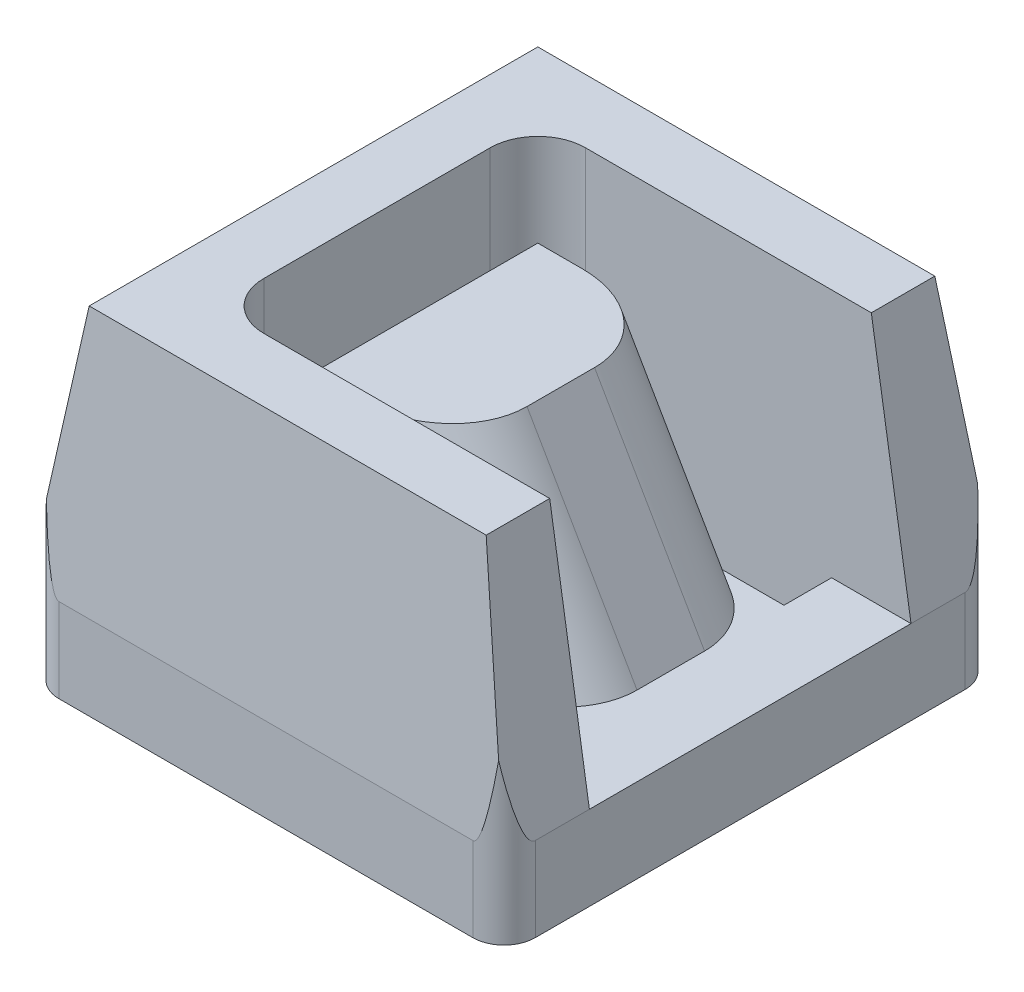
ISO-10303-21;
HEADER;
FILE_DESCRIPTION(('STEP AP214'),'2;1');
FILE_NAME('part.step','',(''),(''),'','','');
FILE_SCHEMA(('AUTOMOTIVE_DESIGN { 1 0 10303 214 1 1 1 1 }'));
ENDSEC;
DATA;
#1=APPLICATION_CONTEXT('core data for automotive mechanical design processes');
#2=APPLICATION_PROTOCOL_DEFINITION('international standard','automotive_design',2000,#1);
#3=PRODUCT_CONTEXT('',#1,'mechanical');
#4=PRODUCT('Part','Part','',(#3));
#5=PRODUCT_RELATED_PRODUCT_CATEGORY('part','',(#4));
#6=PRODUCT_DEFINITION_FORMATION('','',#4);
#7=PRODUCT_DEFINITION_CONTEXT('part definition',#1,'design');
#8=PRODUCT_DEFINITION('design','',#6,#7);
#9=PRODUCT_DEFINITION_SHAPE('','',#8);
#10=(LENGTH_UNIT() NAMED_UNIT(*) SI_UNIT(.MILLI.,.METRE.));
#11=(NAMED_UNIT(*) PLANE_ANGLE_UNIT() SI_UNIT($,.RADIAN.));
#12=(NAMED_UNIT(*) SI_UNIT($,.STERADIAN.) SOLID_ANGLE_UNIT());
#13=UNCERTAINTY_MEASURE_WITH_UNIT(LENGTH_MEASURE(1.E-05),#10,'distance_accuracy_value','');
#14=(GEOMETRIC_REPRESENTATION_CONTEXT(3) GLOBAL_UNCERTAINTY_ASSIGNED_CONTEXT((#13)) GLOBAL_UNIT_ASSIGNED_CONTEXT((#10,
#11,#12)) REPRESENTATION_CONTEXT('',''));
#15=CARTESIAN_POINT('',(0.,0.,0.));
#16=DIRECTION('',(0.,0.,1.));
#17=DIRECTION('',(1.,0.,0.));
#18=AXIS2_PLACEMENT_3D('',#15,#16,#17);
#19=CARTESIAN_POINT('',(14.986,1.3462,3.937));
#20=DIRECTION('',(0.,-1.,0.));
#21=DIRECTION('',(1.,0.,0.));
#22=AXIS2_PLACEMENT_3D('',#19,#20,#21);
#23=PLANE('',#22);
#24=DIRECTION('',(1.,0.,0.));
#25=VECTOR('',#24,1.);
#26=CARTESIAN_POINT('',(-2.159,1.34619999999999,2.57211270759132));
#27=LINE('',#26,#25);
#28=CARTESIAN_POINT('',(2.54,1.34619999999999,2.57211270759132));
#29=VERTEX_POINT('',#28);
#30=CARTESIAN_POINT('',(3.81,1.3462,2.57211270759132));
#31=VERTEX_POINT('',#30);
#32=EDGE_CURVE('E303',#29,#31,#27,.T.);
#33=ORIENTED_EDGE('',*,*,#32,.T.);
#34=DIRECTION('',(0.,0.,1.));
#35=VECTOR('',#34,1.);
#36=CARTESIAN_POINT('',(3.81,1.3462,2.69709573841941));
#37=LINE('',#36,#35);
#38=CARTESIAN_POINT('',(3.81,1.3462,-2.57211270759132));
#39=VERTEX_POINT('',#38);
#40=EDGE_CURVE('E287',#39,#31,#37,.T.);
#41=ORIENTED_EDGE('',*,*,#40,.F.);
#42=DIRECTION('',(-1.,0.,0.));
#43=VECTOR('',#42,1.);
#44=CARTESIAN_POINT('',(3.81,1.3462,-2.57211270759132));
#45=LINE('',#44,#43);
#46=CARTESIAN_POINT('',(2.54,1.34619999999999,-2.57211270759132));
#47=VERTEX_POINT('',#46);
#48=EDGE_CURVE('E300',#39,#47,#45,.T.);
#49=ORIENTED_EDGE('',*,*,#48,.T.);
#50=DIRECTION('',(0.,0.,-1.));
#51=VECTOR('',#50,1.);
#52=CARTESIAN_POINT('',(2.54,1.34619999999999,-2.57211270759132));
#53=LINE('',#52,#51);
#54=CARTESIAN_POINT('',(2.54,1.34619999999999,-1.81011270759132));
#55=VERTEX_POINT('',#54);
#56=EDGE_CURVE('E505',#55,#47,#53,.T.);
#57=ORIENTED_EDGE('',*,*,#56,.F.);
#58=DIRECTION('',(-1.,0.,0.));
#59=VECTOR('',#58,1.);
#60=CARTESIAN_POINT('',(-1.397,1.34619999999999,-1.81011270759132));
#61=LINE('',#60,#59);
#62=CARTESIAN_POINT('',(1.07353031625835,1.34619999999999,-1.81011270759132));
#63=VERTEX_POINT('',#62);
#64=EDGE_CURVE('E510',#55,#63,#61,.T.);
#65=ORIENTED_EDGE('',*,*,#64,.T.);
#66=CARTESIAN_POINT('',(1.07353031625835,1.34619999999999,-0.540112707591319));
#67=DIRECTION('',(0.,-1.,0.));
#68=DIRECTION('',(-1.,0.,0.));
#69=AXIS2_PLACEMENT_3D('',#66,#67,#68);
#70=ELLIPSE('',#69,1.46646968374165,1.27);
#71=CARTESIAN_POINT('',(2.54,1.34619999999999,-0.540112707591319));
#72=VERTEX_POINT('',#71);
#73=EDGE_CURVE('E439',#72,#63,#70,.F.);
#74=ORIENTED_EDGE('',*,*,#73,.F.);
#75=DIRECTION('',(0.,0.,-1.));
#76=VECTOR('',#75,1.);
#77=CARTESIAN_POINT('',(2.54,1.34619999999999,-1.81011270759132));
#78=LINE('',#77,#76);
#79=CARTESIAN_POINT('',(2.54,1.34619999999999,0.540112707591318));
#80=VERTEX_POINT('',#79);
#81=EDGE_CURVE('E393',#80,#72,#78,.T.);
#82=ORIENTED_EDGE('',*,*,#81,.F.);
#83=CARTESIAN_POINT('',(1.07353031625835,1.34619999999999,0.540112707591318));
#84=DIRECTION('',(0.,-1.,0.));
#85=DIRECTION('',(-1.,0.,0.));
#86=AXIS2_PLACEMENT_3D('',#83,#84,#85);
#87=ELLIPSE('',#86,1.46646968374165,1.27);
#88=CARTESIAN_POINT('',(1.07353031625835,1.34619999999999,1.81011270759132));
#89=VERTEX_POINT('',#88);
#90=EDGE_CURVE('E518',#89,#80,#87,.F.);
#91=ORIENTED_EDGE('',*,*,#90,.F.);
#92=DIRECTION('',(1.,0.,0.));
#93=VECTOR('',#92,1.);
#94=CARTESIAN_POINT('',(2.54,1.34619999999999,1.81011270759132));
#95=LINE('',#94,#93);
#96=CARTESIAN_POINT('',(2.54,1.34619999999999,1.81011270759132));
#97=VERTEX_POINT('',#96);
#98=EDGE_CURVE('E509',#89,#97,#95,.T.);
#99=ORIENTED_EDGE('',*,*,#98,.T.);
#100=DIRECTION('',(0.,0.,-1.));
#101=VECTOR('',#100,1.);
#102=CARTESIAN_POINT('',(2.54,1.34619999999999,1.81011270759132));
#103=LINE('',#102,#101);
#104=EDGE_CURVE('E503',#29,#97,#103,.T.);
#105=ORIENTED_EDGE('',*,*,#104,.F.);
#106=EDGE_LOOP('',(#33,#41,#49,#57,#65,#74,#82,#91,#99,#105));
#107=FACE_BOUND('',#106,.T.);
#108=ADVANCED_FACE('F43',(#107),#23,.F.);
#109=CARTESIAN_POINT('',(-3.81,0.,3.937));
#110=DIRECTION('',(0.,1.,0.));
#111=DIRECTION('',(0.,0.,1.));
#112=AXIS2_PLACEMENT_3D('',#109,#110,#111);
#113=PLANE('',#112);
#114=DIRECTION('',(1.,0.,0.));
#115=VECTOR('',#114,1.);
#116=CARTESIAN_POINT('',(2.54,0.,-1.81011270759132));
#117=LINE('',#116,#115);
#118=CARTESIAN_POINT('',(-1.397,0.,-1.81011270759132));
#119=VERTEX_POINT('',#118);
#120=CARTESIAN_POINT('',(2.54,0.,-1.81011270759132));
#121=VERTEX_POINT('',#120);
#122=EDGE_CURVE('E607',#119,#121,#117,.T.);
#123=ORIENTED_EDGE('',*,*,#122,.T.);
#124=DIRECTION('',(0.,0.,-1.));
#125=VECTOR('',#124,1.);
#126=CARTESIAN_POINT('',(2.54,0.,-2.57211270759132));
#127=LINE('',#126,#125);
#128=CARTESIAN_POINT('',(2.54,0.,-2.57211270759132));
#129=VERTEX_POINT('',#128);
#130=EDGE_CURVE('E604',#121,#129,#127,.T.);
#131=ORIENTED_EDGE('',*,*,#130,.T.);
#132=DIRECTION('',(-1.,0.,0.));
#133=VECTOR('',#132,1.);
#134=CARTESIAN_POINT('',(2.54,0.,-2.57211270759132));
#135=LINE('',#134,#133);
#136=CARTESIAN_POINT('',(-1.397,0.,-2.57211270759132));
#137=VERTEX_POINT('',#136);
#138=EDGE_CURVE('E593',#129,#137,#135,.T.);
#139=ORIENTED_EDGE('',*,*,#138,.T.);
#140=CARTESIAN_POINT('',(-1.397,0.,-1.81011270759132));
#141=DIRECTION('',(0.,1.,0.));
#142=DIRECTION('',(0.,0.,1.));
#143=AXIS2_PLACEMENT_3D('',#140,#141,#142);
#144=CIRCLE('',#143,0.762);
#145=CARTESIAN_POINT('',(-2.159,0.,-1.81011270759132));
#146=VERTEX_POINT('',#145);
#147=EDGE_CURVE('E433',#137,#146,#144,.T.);
#148=ORIENTED_EDGE('',*,*,#147,.T.);
#149=DIRECTION('',(0.,0.,1.));
#150=VECTOR('',#149,1.);
#151=CARTESIAN_POINT('',(-2.159,0.,-2.57211270759132));
#152=LINE('',#151,#150);
#153=CARTESIAN_POINT('',(-2.159,0.,1.81011270759132));
#154=VERTEX_POINT('',#153);
#155=EDGE_CURVE('E524',#146,#154,#152,.T.);
#156=ORIENTED_EDGE('',*,*,#155,.T.);
#157=CARTESIAN_POINT('',(-1.397,0.,1.81011270759132));
#158=DIRECTION('',(0.,1.,0.));
#159=DIRECTION('',(0.,0.,1.));
#160=AXIS2_PLACEMENT_3D('',#157,#158,#159);
#161=CIRCLE('',#160,0.762);
#162=CARTESIAN_POINT('',(-1.397,0.,2.57211270759132));
#163=VERTEX_POINT('',#162);
#164=EDGE_CURVE('E427',#154,#163,#161,.T.);
#165=ORIENTED_EDGE('',*,*,#164,.T.);
#166=DIRECTION('',(1.,0.,0.));
#167=VECTOR('',#166,1.);
#168=CARTESIAN_POINT('',(-2.159,0.,2.57211270759132));
#169=LINE('',#168,#167);
#170=CARTESIAN_POINT('',(2.54,0.,2.57211270759132));
#171=VERTEX_POINT('',#170);
#172=EDGE_CURVE('E574',#163,#171,#169,.T.);
#173=ORIENTED_EDGE('',*,*,#172,.T.);
#174=DIRECTION('',(0.,0.,-1.));
#175=VECTOR('',#174,1.);
#176=CARTESIAN_POINT('',(2.54,0.,1.81011270759132));
#177=LINE('',#176,#175);
#178=CARTESIAN_POINT('',(2.54,0.,1.81011270759132));
#179=VERTEX_POINT('',#178);
#180=EDGE_CURVE('E617',#171,#179,#177,.T.);
#181=ORIENTED_EDGE('',*,*,#180,.T.);
#182=DIRECTION('',(-1.,0.,0.));
#183=VECTOR('',#182,1.);
#184=CARTESIAN_POINT('',(-1.397,0.,1.81011270759132));
#185=LINE('',#184,#183);
#186=CARTESIAN_POINT('',(-1.397,0.,1.81011270759132));
#187=VERTEX_POINT('',#186);
#188=EDGE_CURVE('E614',#179,#187,#185,.T.);
#189=ORIENTED_EDGE('',*,*,#188,.T.);
#190=DIRECTION('',(0.,0.,-1.));
#191=VECTOR('',#190,1.);
#192=CARTESIAN_POINT('',(-1.397,0.,-1.81011270759132));
#193=LINE('',#192,#191);
#194=EDGE_CURVE('E610',#187,#119,#193,.T.);
#195=ORIENTED_EDGE('',*,*,#194,.T.);
#196=EDGE_LOOP('',(#123,#131,#139,#148,#156,#165,#173,#181,#189,#195));
#197=FACE_BOUND('',#196,.T.);
#198=CARTESIAN_POINT('',(3.31,0.,-3.437));
#199=DIRECTION('',(0.,1.,0.));
#200=DIRECTION('',(0.,0.,1.));
#201=AXIS2_PLACEMENT_3D('',#198,#199,#200);
#202=CIRCLE('',#201,0.5);
#203=CARTESIAN_POINT('',(3.31,0.,-3.937));
#204=VERTEX_POINT('',#203);
#205=CARTESIAN_POINT('',(3.81,0.,-3.437));
#206=VERTEX_POINT('',#205);
#207=EDGE_CURVE('E453',#204,#206,#202,.F.);
#208=ORIENTED_EDGE('',*,*,#207,.T.);
#209=DIRECTION('',(0.,0.,-1.));
#210=VECTOR('',#209,1.);
#211=CARTESIAN_POINT('',(3.81,0.,2.1971));
#212=LINE('',#211,#210);
#213=CARTESIAN_POINT('',(3.81,0.,3.437));
#214=VERTEX_POINT('',#213);
#215=EDGE_CURVE('E306',#214,#206,#212,.T.);
#216=ORIENTED_EDGE('',*,*,#215,.F.);
#217=CARTESIAN_POINT('',(3.31,0.,3.437));
#218=DIRECTION('',(0.,1.,0.));
#219=DIRECTION('',(0.,0.,1.));
#220=AXIS2_PLACEMENT_3D('',#217,#218,#219);
#221=CIRCLE('',#220,0.5);
#222=CARTESIAN_POINT('',(3.31,0.,3.937));
#223=VERTEX_POINT('',#222);
#224=EDGE_CURVE('E450',#214,#223,#221,.F.);
#225=ORIENTED_EDGE('',*,*,#224,.T.);
#226=DIRECTION('',(1.,0.,0.));
#227=VECTOR('',#226,1.);
#228=CARTESIAN_POINT('',(-3.81,0.,3.937));
#229=LINE('',#228,#227);
#230=CARTESIAN_POINT('',(-3.31,0.,3.937));
#231=VERTEX_POINT('',#230);
#232=EDGE_CURVE('E336',#231,#223,#229,.T.);
#233=ORIENTED_EDGE('',*,*,#232,.F.);
#234=CARTESIAN_POINT('',(-3.31,0.,3.437));
#235=DIRECTION('',(0.,1.,0.));
#236=DIRECTION('',(0.,0.,1.));
#237=AXIS2_PLACEMENT_3D('',#234,#235,#236);
#238=CIRCLE('',#237,0.5);
#239=CARTESIAN_POINT('',(-3.81,0.,3.437));
#240=VERTEX_POINT('',#239);
#241=EDGE_CURVE('E457',#231,#240,#238,.F.);
#242=ORIENTED_EDGE('',*,*,#241,.T.);
#243=DIRECTION('',(0.,0.,-1.));
#244=VECTOR('',#243,1.);
#245=CARTESIAN_POINT('',(-3.81,0.,3.937));
#246=LINE('',#245,#244);
#247=CARTESIAN_POINT('',(-3.81,0.,-3.437));
#248=VERTEX_POINT('',#247);
#249=EDGE_CURVE('E340',#240,#248,#246,.T.);
#250=ORIENTED_EDGE('',*,*,#249,.T.);
#251=CARTESIAN_POINT('',(-3.31,0.,-3.437));
#252=DIRECTION('',(0.,1.,0.));
#253=DIRECTION('',(0.,0.,1.));
#254=AXIS2_PLACEMENT_3D('',#251,#252,#253);
#255=CIRCLE('',#254,0.5);
#256=CARTESIAN_POINT('',(-3.31,0.,-3.937));
#257=VERTEX_POINT('',#256);
#258=EDGE_CURVE('E460',#248,#257,#255,.F.);
#259=ORIENTED_EDGE('',*,*,#258,.T.);
#260=DIRECTION('',(1.,0.,0.));
#261=VECTOR('',#260,1.);
#262=CARTESIAN_POINT('',(-3.81,0.,-3.937));
#263=LINE('',#262,#261);
#264=EDGE_CURVE('E342',#257,#204,#263,.T.);
#265=ORIENTED_EDGE('',*,*,#264,.T.);
#266=EDGE_LOOP('',(#208,#216,#225,#233,#242,#250,#259,#265));
#267=FACE_BOUND('',#266,.T.);
#268=ADVANCED_FACE('F549',(#197,#267),#113,.F.);
#269=CARTESIAN_POINT('',(1.44014773719376,0.711199999999993,0.540112707591318));
#270=DIRECTION('',(-0.500000000000001,0.866025403784438,0.));
#271=DIRECTION('',(-0.866025403784438,-0.500000000000001,0.));
#272=AXIS2_PLACEMENT_3D('',#269,#270,#271);
#273=CYLINDRICAL_SURFACE('',#272,1.27);
#274=DIRECTION('',(-0.500000000000001,0.866025403784438,0.));
#275=VECTOR('',#274,1.);
#276=CARTESIAN_POINT('',(1.03881943648107,1.40632100734966,1.81011270759132));
#277=LINE('',#276,#275);
#278=CARTESIAN_POINT('',(-0.686233304231633,4.39419999999999,1.81011270759132));
#279=VERTEX_POINT('',#278);
#280=EDGE_CURVE('E400',#89,#279,#277,.T.);
#281=ORIENTED_EDGE('',*,*,#280,.F.);
#282=ORIENTED_EDGE('',*,*,#90,.T.);
#283=DIRECTION('',(0.500000000000001,-0.866025403784438,0.));
#284=VECTOR('',#283,1.);
#285=CARTESIAN_POINT('',(2.54,1.34619999999999,0.540112707591318));
#286=LINE('',#285,#284);
#287=CARTESIAN_POINT('',(0.780236379510016,4.39419999999999,0.540112707591318));
#288=VERTEX_POINT('',#287);
#289=EDGE_CURVE('E396',#288,#80,#286,.T.);
#290=ORIENTED_EDGE('',*,*,#289,.F.);
#291=CARTESIAN_POINT('',(-0.686233304231634,4.39419999999999,0.540112707591319));
#292=DIRECTION('',(0.,-1.,0.));
#293=DIRECTION('',(-1.,0.,0.));
#294=AXIS2_PLACEMENT_3D('',#291,#292,#293);
#295=ELLIPSE('',#294,1.46646968374165,1.27);
#296=EDGE_CURVE('E406',#279,#288,#295,.F.);
#297=ORIENTED_EDGE('',*,*,#296,.F.);
#298=EDGE_LOOP('',(#281,#282,#290,#297));
#299=FACE_BOUND('',#298,.T.);
#300=ADVANCED_FACE('F659',(#299),#273,.T.);
#301=CARTESIAN_POINT('',(2.02306943648107,-0.298450000000005,-0.540112707591318));
#302=DIRECTION('',(-0.500000000000001,0.866025403784438,0.));
#303=DIRECTION('',(-0.866025403784438,-0.500000000000001,0.));
#304=AXIS2_PLACEMENT_3D('',#301,#302,#303);
#305=CYLINDRICAL_SURFACE('',#304,1.27);
#306=DIRECTION('',(0.500000000000001,-0.866025403784438,0.));
#307=VECTOR('',#306,1.);
#308=CARTESIAN_POINT('',(2.54,1.34619999999999,-0.540112707591319));
#309=LINE('',#308,#307);
#310=CARTESIAN_POINT('',(0.780236379510015,4.39419999999999,-0.540112707591319));
#311=VERTEX_POINT('',#310);
#312=EDGE_CURVE('E387',#72,#311,#309,.F.);
#313=ORIENTED_EDGE('',*,*,#312,.F.);
#314=ORIENTED_EDGE('',*,*,#73,.T.);
#315=DIRECTION('',(-0.500000000000001,0.866025403784438,0.));
#316=VECTOR('',#315,1.);
#317=CARTESIAN_POINT('',(2.02306943648107,-0.298450000000005,-1.81011270759132));
#318=LINE('',#317,#316);
#319=CARTESIAN_POINT('',(-0.686233304231633,4.39419999999999,-1.81011270759132));
#320=VERTEX_POINT('',#319);
#321=EDGE_CURVE('E409',#320,#63,#318,.F.);
#322=ORIENTED_EDGE('',*,*,#321,.F.);
#323=CARTESIAN_POINT('',(-0.686233304231634,4.39419999999999,-0.540112707591319));
#324=DIRECTION('',(0.,-1.,0.));
#325=DIRECTION('',(-1.,0.,0.));
#326=AXIS2_PLACEMENT_3D('',#323,#324,#325);
#327=ELLIPSE('',#326,1.46646968374165,1.27);
#328=EDGE_CURVE('E403',#311,#320,#327,.F.);
#329=ORIENTED_EDGE('',*,*,#328,.F.);
#330=EDGE_LOOP('',(#313,#314,#322,#329));
#331=FACE_BOUND('',#330,.T.);
#332=ADVANCED_FACE('F677',(#331),#305,.T.);
#333=CARTESIAN_POINT('',(3.81,1.3462,3.937));
#334=DIRECTION('',(-0.987558114500863,-0.157254476831347,0.));
#335=DIRECTION('',(0.157254476831347,-0.987558114500863,0.));
#336=AXIS2_PLACEMENT_3D('',#333,#334,#335);
#337=PLANE('',#336);
#338=DIRECTION('',(0.,0.,-1.));
#339=VECTOR('',#338,1.);
#340=CARTESIAN_POINT('',(3.81,1.3462,3.937));
#341=LINE('',#340,#339);
#342=CARTESIAN_POINT('',(3.81,1.3462,-3.437));
#343=VERTEX_POINT('',#342);
#344=EDGE_CURVE('E284',#39,#343,#341,.T.);
#345=ORIENTED_EDGE('',*,*,#344,.T.);
#346=CARTESIAN_POINT('',(3.31,4.4862,-3.437));
#347=DIRECTION('',(-0.987558114500863,-0.157254476831347,0.));
#348=DIRECTION('',(0.157254476831347,-0.987558114500863,0.));
#349=AXIS2_PLACEMENT_3D('',#346,#347,#348);
#350=ELLIPSE('',#349,3.1795597179484,0.5);
#351=CARTESIAN_POINT('',(3.61752151282684,2.55496489944744,-3.83124677443029));
#352=VERTEX_POINT('',#351);
#353=EDGE_CURVE('E72',#343,#352,#350,.F.);
#354=ORIENTED_EDGE('',*,*,#353,.T.);
#355=DIRECTION('',(-0.156670791620332,0.983892571375686,0.0860794461227438));
#356=VECTOR('',#355,1.);
#357=CARTESIAN_POINT('',(4.08432315611902,-0.376549420427436,-4.08772104438326));
#358=LINE('',#357,#356);
#359=CARTESIAN_POINT('',(3.175,5.334,-3.58811270759132));
#360=VERTEX_POINT('',#359);
#361=EDGE_CURVE('E324',#352,#360,#358,.T.);
#362=ORIENTED_EDGE('',*,*,#361,.T.);
#363=DIRECTION('',(0.,0.,-1.));
#364=VECTOR('',#363,1.);
#365=CARTESIAN_POINT('',(3.175,5.334,3.937));
#366=LINE('',#365,#364);
#367=CARTESIAN_POINT('',(3.175,5.334,-2.57211270759132));
#368=VERTEX_POINT('',#367);
#369=EDGE_CURVE('E322',#368,#360,#366,.T.);
#370=ORIENTED_EDGE('',*,*,#369,.F.);
#371=DIRECTION('',(-0.157254476831347,0.987558114500863,0.));
#372=VECTOR('',#371,1.);
#373=CARTESIAN_POINT('',(3.81,1.3462,-2.57211270759132));
#374=LINE('',#373,#372);
#375=EDGE_CURVE('E312',#39,#368,#374,.T.);
#376=ORIENTED_EDGE('',*,*,#375,.F.);
#377=EDGE_LOOP('',(#345,#354,#362,#370,#376));
#378=FACE_BOUND('',#377,.T.);
#379=ADVANCED_FACE('F320',(#378),#337,.F.);
#380=DIRECTION('',(0.156670791620332,-0.983892571375686,0.0860794461227438));
#381=VECTOR('',#380,1.);
#382=CARTESIAN_POINT('',(4.08432315611902,-0.376549420427436,4.08772104438326));
#383=LINE('',#382,#381);
#384=CARTESIAN_POINT('',(3.61752151282684,2.55496489944745,3.83124677443029));
#385=VERTEX_POINT('',#384);
#386=CARTESIAN_POINT('',(3.175,5.334,3.58811270759132));
#387=VERTEX_POINT('',#386);
#388=EDGE_CURVE('E346',#385,#387,#383,.F.);
#389=ORIENTED_EDGE('',*,*,#388,.F.);
#390=CARTESIAN_POINT('',(3.31,4.4862,3.437));
#391=DIRECTION('',(-0.987558114500863,-0.157254476831347,0.));
#392=DIRECTION('',(0.157254476831347,-0.987558114500863,0.));
#393=AXIS2_PLACEMENT_3D('',#390,#391,#392);
#394=ELLIPSE('',#393,3.1795597179484,0.5);
#395=CARTESIAN_POINT('',(3.81,1.3462,3.437));
#396=VERTEX_POINT('',#395);
#397=EDGE_CURVE('E52',#385,#396,#394,.F.);
#398=ORIENTED_EDGE('',*,*,#397,.T.);
#399=EDGE_CURVE('E293',#396,#31,#341,.T.);
#400=ORIENTED_EDGE('',*,*,#399,.T.);
#401=DIRECTION('',(0.157254476831347,-0.987558114500863,0.));
#402=VECTOR('',#401,1.);
#403=CARTESIAN_POINT('',(3.81,1.3462,2.57211270759132));
#404=LINE('',#403,#402);
#405=CARTESIAN_POINT('',(3.175,5.334,2.57211270759132));
#406=VERTEX_POINT('',#405);
#407=EDGE_CURVE('E325',#406,#31,#404,.T.);
#408=ORIENTED_EDGE('',*,*,#407,.F.);
#409=EDGE_CURVE('E294',#387,#406,#366,.T.);
#410=ORIENTED_EDGE('',*,*,#409,.F.);
#411=EDGE_LOOP('',(#389,#398,#400,#408,#410));
#412=FACE_BOUND('',#411,.T.);
#413=ADVANCED_FACE('F568',(#412),#337,.F.);
#414=CARTESIAN_POINT('',(3.175,5.334,3.937));
#415=DIRECTION('',(0.,-1.,0.));
#416=DIRECTION('',(0.,0.,-1.));
#417=AXIS2_PLACEMENT_3D('',#414,#415,#416);
#418=PLANE('',#417);
#419=DIRECTION('',(-1.,0.,0.));
#420=VECTOR('',#419,1.);
#421=CARTESIAN_POINT('',(3.175,5.334,-2.57211270759132));
#422=LINE('',#421,#420);
#423=CARTESIAN_POINT('',(-1.397,5.334,-2.57211270759132));
#424=VERTEX_POINT('',#423);
#425=EDGE_CURVE('E373',#368,#424,#422,.T.);
#426=ORIENTED_EDGE('',*,*,#425,.F.);
#427=ORIENTED_EDGE('',*,*,#369,.T.);
#428=DIRECTION('',(-1.,0.,0.));
#429=VECTOR('',#428,1.);
#430=CARTESIAN_POINT('',(14.986,5.334,-3.58811270759132));
#431=LINE('',#430,#429);
#432=CARTESIAN_POINT('',(-3.175,5.334,-3.58811270759132));
#433=VERTEX_POINT('',#432);
#434=EDGE_CURVE('E329',#360,#433,#431,.T.);
#435=ORIENTED_EDGE('',*,*,#434,.T.);
#436=DIRECTION('',(0.,0.,-1.));
#437=VECTOR('',#436,1.);
#438=CARTESIAN_POINT('',(-3.175,5.334,3.937));
#439=LINE('',#438,#437);
#440=CARTESIAN_POINT('',(-3.175,5.334,3.58811270759132));
#441=VERTEX_POINT('',#440);
#442=EDGE_CURVE('E355',#441,#433,#439,.T.);
#443=ORIENTED_EDGE('',*,*,#442,.F.);
#444=DIRECTION('',(1.,0.,0.));
#445=VECTOR('',#444,1.);
#446=CARTESIAN_POINT('',(14.986,5.334,3.58811270759132));
#447=LINE('',#446,#445);
#448=EDGE_CURVE('E380',#387,#441,#447,.F.);
#449=ORIENTED_EDGE('',*,*,#448,.F.);
#450=ORIENTED_EDGE('',*,*,#409,.T.);
#451=DIRECTION('',(1.,0.,0.));
#452=VECTOR('',#451,1.);
#453=CARTESIAN_POINT('',(-2.159,5.334,2.57211270759132));
#454=LINE('',#453,#452);
#455=CARTESIAN_POINT('',(-1.397,5.334,2.57211270759132));
#456=VERTEX_POINT('',#455);
#457=EDGE_CURVE('E332',#456,#406,#454,.T.);
#458=ORIENTED_EDGE('',*,*,#457,.F.);
#459=CARTESIAN_POINT('',(-1.397,5.334,1.81011270759132));
#460=DIRECTION('',(0.,-1.,0.));
#461=DIRECTION('',(0.,0.,-1.));
#462=AXIS2_PLACEMENT_3D('',#459,#460,#461);
#463=CIRCLE('',#462,0.762);
#464=CARTESIAN_POINT('',(-2.159,5.334,1.81011270759132));
#465=VERTEX_POINT('',#464);
#466=EDGE_CURVE('E430',#456,#465,#463,.T.);
#467=ORIENTED_EDGE('',*,*,#466,.T.);
#468=DIRECTION('',(0.,0.,1.));
#469=VECTOR('',#468,1.);
#470=CARTESIAN_POINT('',(-2.159,5.334,-2.57211270759132));
#471=LINE('',#470,#469);
#472=CARTESIAN_POINT('',(-2.159,5.334,-1.81011270759132));
#473=VERTEX_POINT('',#472);
#474=EDGE_CURVE('E499',#473,#465,#471,.T.);
#475=ORIENTED_EDGE('',*,*,#474,.F.);
#476=CARTESIAN_POINT('',(-1.397,5.334,-1.81011270759132));
#477=DIRECTION('',(0.,-1.,0.));
#478=DIRECTION('',(0.,0.,-1.));
#479=AXIS2_PLACEMENT_3D('',#476,#477,#478);
#480=CIRCLE('',#479,0.762);
#481=EDGE_CURVE('E436',#473,#424,#480,.T.);
#482=ORIENTED_EDGE('',*,*,#481,.T.);
#483=EDGE_LOOP('',(#426,#427,#435,#443,#449,#450,#458,#467,#475,#482));
#484=FACE_BOUND('',#483,.T.);
#485=ADVANCED_FACE('F528',(#484),#418,.F.);
#486=CARTESIAN_POINT('',(14.986,1.3462,-3.937));
#487=DIRECTION('',(0.,0.0871557427476584,-0.996194698091746));
#488=DIRECTION('',(0.,0.996194698091746,0.0871557427476584));
#489=AXIS2_PLACEMENT_3D('',#486,#487,#488);
#490=PLANE('',#489);
#491=DIRECTION('',(-1.,0.,0.));
#492=VECTOR('',#491,1.);
#493=CARTESIAN_POINT('',(14.986,1.3462,-3.937));
#494=LINE('',#493,#492);
#495=CARTESIAN_POINT('',(3.31,1.34619999999999,-3.937));
#496=VERTEX_POINT('',#495);
#497=CARTESIAN_POINT('',(-3.31,1.34619999999999,-3.937));
#498=VERTEX_POINT('',#497);
#499=EDGE_CURVE('E369',#496,#498,#494,.T.);
#500=ORIENTED_EDGE('',*,*,#499,.T.);
#501=CARTESIAN_POINT('',(-3.30999999999999,7.06122615138066,-3.437));
#502=DIRECTION('',(0.,0.0871557427476584,-0.996194698091746));
#503=DIRECTION('',(0.,0.996194698091746,0.0871557427476584));
#504=AXIS2_PLACEMENT_3D('',#501,#502,#503);
#505=ELLIPSE('',#504,5.73685662283492,0.5);
#506=CARTESIAN_POINT('',(-3.61752151282684,2.55496489944746,-3.83124677443029));
#507=VERTEX_POINT('',#506);
#508=EDGE_CURVE('E471',#498,#507,#505,.T.);
#509=ORIENTED_EDGE('',*,*,#508,.T.);
#510=DIRECTION('',(-0.156670791620332,-0.983892571375686,-0.0860794461227438));
#511=VECTOR('',#510,1.);
#512=CARTESIAN_POINT('',(-3.34863832834529,4.2435512979916,-3.68351460717361));
#513=LINE('',#512,#511);
#514=EDGE_CURVE('E347',#433,#507,#513,.T.);
#515=ORIENTED_EDGE('',*,*,#514,.F.);
#516=ORIENTED_EDGE('',*,*,#434,.F.);
#517=ORIENTED_EDGE('',*,*,#361,.F.);
#518=CARTESIAN_POINT('',(3.31,7.06122615138065,-3.437));
#519=DIRECTION('',(0.,0.0871557427476584,-0.996194698091746));
#520=DIRECTION('',(0.,-0.996194698091746,-0.0871557427476584));
#521=AXIS2_PLACEMENT_3D('',#518,#519,#520);
#522=ELLIPSE('',#521,5.73685662283492,0.5);
#523=EDGE_CURVE('E468',#352,#496,#522,.T.);
#524=ORIENTED_EDGE('',*,*,#523,.T.);
#525=EDGE_LOOP('',(#500,#509,#515,#516,#517,#524));
#526=FACE_BOUND('',#525,.T.);
#527=ADVANCED_FACE('F533',(#526),#490,.T.);
#528=CARTESIAN_POINT('',(14.986,1.3462,3.937));
#529=DIRECTION('',(0.,0.0871557427476584,0.996194698091746));
#530=DIRECTION('',(0.,-0.996194698091746,0.0871557427476584));
#531=AXIS2_PLACEMENT_3D('',#528,#529,#530);
#532=PLANE('',#531);
#533=DIRECTION('',(0.156670791620332,0.983892571375686,-0.0860794461227438));
#534=VECTOR('',#533,1.);
#535=CARTESIAN_POINT('',(-3.34863832834529,4.2435512979916,3.68351460717361));
#536=LINE('',#535,#534);
#537=CARTESIAN_POINT('',(-3.61752151282684,2.55496489944745,3.83124677443029));
#538=VERTEX_POINT('',#537);
#539=EDGE_CURVE('E341',#441,#538,#536,.F.);
#540=ORIENTED_EDGE('',*,*,#539,.T.);
#541=CARTESIAN_POINT('',(-3.30999999999999,7.06122615138065,3.437));
#542=DIRECTION('',(0.,0.0871557427476584,0.996194698091746));
#543=DIRECTION('',(0.,-0.996194698091746,0.0871557427476584));
#544=AXIS2_PLACEMENT_3D('',#541,#542,#543);
#545=ELLIPSE('',#544,5.73685662283492,0.5);
#546=CARTESIAN_POINT('',(-3.31,1.34619999999999,3.937));
#547=VERTEX_POINT('',#546);
#548=EDGE_CURVE('E491',#538,#547,#545,.T.);
#549=ORIENTED_EDGE('',*,*,#548,.T.);
#550=DIRECTION('',(1.,0.,0.));
#551=VECTOR('',#550,1.);
#552=CARTESIAN_POINT('',(14.986,1.3462,3.937));
#553=LINE('',#552,#551);
#554=CARTESIAN_POINT('',(3.31,1.34619999999999,3.937));
#555=VERTEX_POINT('',#554);
#556=EDGE_CURVE('E362',#555,#547,#553,.F.);
#557=ORIENTED_EDGE('',*,*,#556,.F.);
#558=CARTESIAN_POINT('',(3.31,7.06122615138066,3.437));
#559=DIRECTION('',(0.,0.0871557427476584,0.996194698091746));
#560=DIRECTION('',(0.,-0.996194698091746,0.0871557427476584));
#561=AXIS2_PLACEMENT_3D('',#558,#559,#560);
#562=ELLIPSE('',#561,5.73685662283492,0.5);
#563=EDGE_CURVE('E488',#555,#385,#562,.T.);
#564=ORIENTED_EDGE('',*,*,#563,.T.);
#565=ORIENTED_EDGE('',*,*,#388,.T.);
#566=ORIENTED_EDGE('',*,*,#448,.T.);
#567=EDGE_LOOP('',(#540,#549,#557,#564,#565,#566));
#568=FACE_BOUND('',#567,.T.);
#569=ADVANCED_FACE('F562',(#568),#532,.T.);
#570=CARTESIAN_POINT('',(-3.175,5.334,3.937));
#571=DIRECTION('',(0.987558114500863,-0.157254476831347,0.));
#572=DIRECTION('',(0.157254476831347,0.987558114500863,0.));
#573=AXIS2_PLACEMENT_3D('',#570,#571,#572);
#574=PLANE('',#573);
#575=ORIENTED_EDGE('',*,*,#514,.T.);
#576=CARTESIAN_POINT('',(-3.31,4.48620000000003,-3.437));
#577=DIRECTION('',(0.987558114500863,-0.157254476831347,0.));
#578=DIRECTION('',(0.157254476831347,0.987558114500863,0.));
#579=AXIS2_PLACEMENT_3D('',#576,#577,#578);
#580=ELLIPSE('',#579,3.17955971794841,0.5);
#581=CARTESIAN_POINT('',(-3.81,1.3462,-3.437));
#582=VERTEX_POINT('',#581);
#583=EDGE_CURVE('E477',#507,#582,#580,.F.);
#584=ORIENTED_EDGE('',*,*,#583,.T.);
#585=DIRECTION('',(0.,0.,-1.));
#586=VECTOR('',#585,1.);
#587=CARTESIAN_POINT('',(-3.81,1.3462,3.937));
#588=LINE('',#587,#586);
#589=CARTESIAN_POINT('',(-3.81,1.3462,3.437));
#590=VERTEX_POINT('',#589);
#591=EDGE_CURVE('E351',#590,#582,#588,.T.);
#592=ORIENTED_EDGE('',*,*,#591,.F.);
#593=CARTESIAN_POINT('',(-3.31,4.48620000000002,3.437));
#594=DIRECTION('',(0.987558114500863,-0.157254476831347,0.));
#595=DIRECTION('',(-0.157254476831347,-0.987558114500863,0.));
#596=AXIS2_PLACEMENT_3D('',#593,#594,#595);
#597=ELLIPSE('',#596,3.17955971794841,0.5);
#598=EDGE_CURVE('E474',#590,#538,#597,.F.);
#599=ORIENTED_EDGE('',*,*,#598,.T.);
#600=ORIENTED_EDGE('',*,*,#539,.F.);
#601=ORIENTED_EDGE('',*,*,#442,.T.);
#602=EDGE_LOOP('',(#575,#584,#592,#599,#600,#601));
#603=FACE_BOUND('',#602,.T.);
#604=ADVANCED_FACE('F537',(#603),#574,.F.);
#605=CARTESIAN_POINT('',(-3.81,1.3462,3.937));
#606=DIRECTION('',(1.,0.,0.));
#607=DIRECTION('',(0.,1.,0.));
#608=AXIS2_PLACEMENT_3D('',#605,#606,#607);
#609=PLANE('',#608);
#610=ORIENTED_EDGE('',*,*,#591,.T.);
#611=DIRECTION('',(0.,-1.,0.));
#612=VECTOR('',#611,1.);
#613=CARTESIAN_POINT('',(-3.81,0.,-3.437));
#614=LINE('',#613,#612);
#615=EDGE_CURVE('E446',#582,#248,#614,.T.);
#616=ORIENTED_EDGE('',*,*,#615,.T.);
#617=ORIENTED_EDGE('',*,*,#249,.F.);
#618=DIRECTION('',(0.,-1.,0.));
#619=VECTOR('',#618,1.);
#620=CARTESIAN_POINT('',(-3.81,1.3462,3.437));
#621=LINE('',#620,#619);
#622=EDGE_CURVE('E443',#240,#590,#621,.F.);
#623=ORIENTED_EDGE('',*,*,#622,.T.);
#624=EDGE_LOOP('',(#610,#616,#617,#623));
#625=FACE_BOUND('',#624,.T.);
#626=ADVANCED_FACE('F546',(#625),#609,.F.);
#627=CARTESIAN_POINT('',(14.986,1.3462,3.937));
#628=DIRECTION('',(0.,0.,-1.));
#629=DIRECTION('',(-1.,0.,0.));
#630=AXIS2_PLACEMENT_3D('',#627,#628,#629);
#631=PLANE('',#630);
#632=ORIENTED_EDGE('',*,*,#556,.T.);
#633=DIRECTION('',(0.,-1.,0.));
#634=VECTOR('',#633,1.);
#635=CARTESIAN_POINT('',(-3.31,1.34620000000002,3.937));
#636=LINE('',#635,#634);
#637=EDGE_CURVE('E484',#547,#231,#636,.T.);
#638=ORIENTED_EDGE('',*,*,#637,.T.);
#639=ORIENTED_EDGE('',*,*,#232,.T.);
#640=DIRECTION('',(0.,1.,0.));
#641=VECTOR('',#640,1.);
#642=CARTESIAN_POINT('',(3.31,1.34619999999999,3.937));
#643=LINE('',#642,#641);
#644=EDGE_CURVE('E480',#223,#555,#643,.T.);
#645=ORIENTED_EDGE('',*,*,#644,.T.);
#646=EDGE_LOOP('',(#632,#638,#639,#645));
#647=FACE_BOUND('',#646,.T.);
#648=ADVANCED_FACE('F558',(#647),#631,.F.);
#649=CARTESIAN_POINT('',(14.986,1.3462,-3.937));
#650=DIRECTION('',(0.,0.,-1.));
#651=DIRECTION('',(-1.,0.,0.));
#652=AXIS2_PLACEMENT_3D('',#649,#650,#651);
#653=PLANE('',#652);
#654=ORIENTED_EDGE('',*,*,#264,.F.);
#655=DIRECTION('',(0.,-1.,0.));
#656=VECTOR('',#655,1.);
#657=CARTESIAN_POINT('',(-3.31,1.3462,-3.937));
#658=LINE('',#657,#656);
#659=EDGE_CURVE('E465',#257,#498,#658,.F.);
#660=ORIENTED_EDGE('',*,*,#659,.T.);
#661=ORIENTED_EDGE('',*,*,#499,.F.);
#662=DIRECTION('',(0.,1.,0.));
#663=VECTOR('',#662,1.);
#664=CARTESIAN_POINT('',(3.31,0.,-3.937));
#665=LINE('',#664,#663);
#666=EDGE_CURVE('E462',#496,#204,#665,.F.);
#667=ORIENTED_EDGE('',*,*,#666,.T.);
#668=EDGE_LOOP('',(#654,#660,#661,#667));
#669=FACE_BOUND('',#668,.T.);
#670=ADVANCED_FACE('F724',(#669),#653,.T.);
#671=CARTESIAN_POINT('',(3.81,5.334,-2.57211270759132));
#672=DIRECTION('',(0.,0.,1.));
#673=DIRECTION('',(1.,0.,0.));
#674=AXIS2_PLACEMENT_3D('',#671,#672,#673);
#675=PLANE('',#674);
#676=ORIENTED_EDGE('',*,*,#425,.T.);
#677=DIRECTION('',(0.,-1.,0.));
#678=VECTOR('',#677,1.);
#679=CARTESIAN_POINT('',(-1.397,0.,-2.57211270759132));
#680=LINE('',#679,#678);
#681=EDGE_CURVE('E423',#424,#137,#680,.T.);
#682=ORIENTED_EDGE('',*,*,#681,.T.);
#683=ORIENTED_EDGE('',*,*,#138,.F.);
#684=DIRECTION('',(0.,1.,0.));
#685=VECTOR('',#684,1.);
#686=CARTESIAN_POINT('',(2.54,0.,-2.57211270759132));
#687=LINE('',#686,#685);
#688=EDGE_CURVE('E316',#129,#47,#687,.T.);
#689=ORIENTED_EDGE('',*,*,#688,.T.);
#690=ORIENTED_EDGE('',*,*,#48,.F.);
#691=ORIENTED_EDGE('',*,*,#375,.T.);
#692=EDGE_LOOP('',(#676,#682,#683,#689,#690,#691));
#693=FACE_BOUND('',#692,.T.);
#694=ADVANCED_FACE('F311',(#693),#675,.T.);
#695=CARTESIAN_POINT('',(-2.159,5.334,2.57211270759132));
#696=DIRECTION('',(0.,0.,-1.));
#697=DIRECTION('',(-1.,0.,0.));
#698=AXIS2_PLACEMENT_3D('',#695,#696,#697);
#699=PLANE('',#698);
#700=ORIENTED_EDGE('',*,*,#172,.F.);
#701=DIRECTION('',(0.,-1.,0.));
#702=VECTOR('',#701,1.);
#703=CARTESIAN_POINT('',(-1.397,5.334,2.57211270759132));
#704=LINE('',#703,#702);
#705=EDGE_CURVE('E420',#163,#456,#704,.F.);
#706=ORIENTED_EDGE('',*,*,#705,.T.);
#707=ORIENTED_EDGE('',*,*,#457,.T.);
#708=ORIENTED_EDGE('',*,*,#407,.T.);
#709=ORIENTED_EDGE('',*,*,#32,.F.);
#710=DIRECTION('',(0.,1.,0.));
#711=VECTOR('',#710,1.);
#712=CARTESIAN_POINT('',(2.54,0.,2.57211270759132));
#713=LINE('',#712,#711);
#714=EDGE_CURVE('E589',#171,#29,#713,.T.);
#715=ORIENTED_EDGE('',*,*,#714,.F.);
#716=EDGE_LOOP('',(#700,#706,#707,#708,#709,#715));
#717=FACE_BOUND('',#716,.T.);
#718=ADVANCED_FACE('F571',(#717),#699,.T.);
#719=CARTESIAN_POINT('',(-2.159,5.334,-2.57211270759132));
#720=DIRECTION('',(1.,0.,0.));
#721=DIRECTION('',(0.,1.,0.));
#722=AXIS2_PLACEMENT_3D('',#719,#720,#721);
#723=PLANE('',#722);
#724=ORIENTED_EDGE('',*,*,#474,.T.);
#725=DIRECTION('',(0.,-1.,0.));
#726=VECTOR('',#725,1.);
#727=CARTESIAN_POINT('',(-2.159,0.,1.81011270759132));
#728=LINE('',#727,#726);
#729=EDGE_CURVE('E416',#465,#154,#728,.T.);
#730=ORIENTED_EDGE('',*,*,#729,.T.);
#731=ORIENTED_EDGE('',*,*,#155,.F.);
#732=DIRECTION('',(0.,-1.,0.));
#733=VECTOR('',#732,1.);
#734=CARTESIAN_POINT('',(-2.159,5.334,-1.81011270759132));
#735=LINE('',#734,#733);
#736=EDGE_CURVE('E413',#146,#473,#735,.F.);
#737=ORIENTED_EDGE('',*,*,#736,.T.);
#738=EDGE_LOOP('',(#724,#730,#731,#737));
#739=FACE_BOUND('',#738,.T.);
#740=ADVANCED_FACE('F582',(#739),#723,.T.);
#741=CARTESIAN_POINT('',(2.54,0.,-2.57211270759132));
#742=DIRECTION('',(1.,0.,0.));
#743=DIRECTION('',(0.,1.,0.));
#744=AXIS2_PLACEMENT_3D('',#741,#742,#743);
#745=PLANE('',#744);
#746=ORIENTED_EDGE('',*,*,#130,.F.);
#747=DIRECTION('',(0.,-1.,0.));
#748=VECTOR('',#747,1.);
#749=CARTESIAN_POINT('',(2.54,6.69465782041274,-1.81011270759132));
#750=LINE('',#749,#748);
#751=EDGE_CURVE('E633',#55,#121,#750,.T.);
#752=ORIENTED_EDGE('',*,*,#751,.F.);
#753=ORIENTED_EDGE('',*,*,#56,.T.);
#754=ORIENTED_EDGE('',*,*,#688,.F.);
#755=EDGE_LOOP('',(#746,#752,#753,#754));
#756=FACE_BOUND('',#755,.T.);
#757=ADVANCED_FACE('F699',(#756),#745,.F.);
#758=CARTESIAN_POINT('',(2.54,0.,-1.81011270759132));
#759=DIRECTION('',(0.,0.,1.));
#760=DIRECTION('',(1.,0.,0.));
#761=AXIS2_PLACEMENT_3D('',#758,#759,#760);
#762=PLANE('',#761);
#763=DIRECTION('',(0.,1.,0.));
#764=VECTOR('',#763,1.);
#765=CARTESIAN_POINT('',(-1.397,0.,-1.81011270759132));
#766=LINE('',#765,#764);
#767=CARTESIAN_POINT('',(-1.397,4.39419999999999,-1.81011270759132));
#768=VERTEX_POINT('',#767);
#769=EDGE_CURVE('E596',#119,#768,#766,.T.);
#770=ORIENTED_EDGE('',*,*,#769,.T.);
#771=DIRECTION('',(-1.,0.,0.));
#772=VECTOR('',#771,1.);
#773=CARTESIAN_POINT('',(-1.397,4.39419999999999,-1.81011270759132));
#774=LINE('',#773,#772);
#775=EDGE_CURVE('E392',#320,#768,#774,.T.);
#776=ORIENTED_EDGE('',*,*,#775,.F.);
#777=ORIENTED_EDGE('',*,*,#321,.T.);
#778=ORIENTED_EDGE('',*,*,#64,.F.);
#779=ORIENTED_EDGE('',*,*,#751,.T.);
#780=ORIENTED_EDGE('',*,*,#122,.F.);
#781=EDGE_LOOP('',(#770,#776,#777,#778,#779,#780));
#782=FACE_BOUND('',#781,.T.);
#783=ADVANCED_FACE('F702',(#782),#762,.F.);
#784=CARTESIAN_POINT('',(-1.397,0.,-1.81011270759132));
#785=DIRECTION('',(1.,0.,0.));
#786=DIRECTION('',(0.,1.,0.));
#787=AXIS2_PLACEMENT_3D('',#784,#785,#786);
#788=PLANE('',#787);
#789=DIRECTION('',(0.,1.,0.));
#790=VECTOR('',#789,1.);
#791=CARTESIAN_POINT('',(-1.397,0.,1.81011270759132));
#792=LINE('',#791,#790);
#793=CARTESIAN_POINT('',(-1.397,4.39419999999999,1.81011270759132));
#794=VERTEX_POINT('',#793);
#795=EDGE_CURVE('E592',#187,#794,#792,.T.);
#796=ORIENTED_EDGE('',*,*,#795,.T.);
#797=DIRECTION('',(0.,0.,1.));
#798=VECTOR('',#797,1.);
#799=CARTESIAN_POINT('',(-1.397,4.39419999999999,1.81011270759132));
#800=LINE('',#799,#798);
#801=EDGE_CURVE('E516',#768,#794,#800,.T.);
#802=ORIENTED_EDGE('',*,*,#801,.F.);
#803=ORIENTED_EDGE('',*,*,#769,.F.);
#804=ORIENTED_EDGE('',*,*,#194,.F.);
#805=EDGE_LOOP('',(#796,#802,#803,#804));
#806=FACE_BOUND('',#805,.T.);
#807=ADVANCED_FACE('F706',(#806),#788,.F.);
#808=CARTESIAN_POINT('',(-1.397,0.,1.81011270759132));
#809=DIRECTION('',(0.,0.,-1.));
#810=DIRECTION('',(-1.,0.,0.));
#811=AXIS2_PLACEMENT_3D('',#808,#809,#810);
#812=PLANE('',#811);
#813=ORIENTED_EDGE('',*,*,#188,.F.);
#814=DIRECTION('',(0.,-1.,0.));
#815=VECTOR('',#814,1.);
#816=CARTESIAN_POINT('',(2.54,6.69465782041274,1.81011270759132));
#817=LINE('',#816,#815);
#818=EDGE_CURVE('E511',#97,#179,#817,.T.);
#819=ORIENTED_EDGE('',*,*,#818,.F.);
#820=ORIENTED_EDGE('',*,*,#98,.F.);
#821=ORIENTED_EDGE('',*,*,#280,.T.);
#822=DIRECTION('',(1.,0.,0.));
#823=VECTOR('',#822,1.);
#824=CARTESIAN_POINT('',(2.54,4.3942,1.81011270759132));
#825=LINE('',#824,#823);
#826=EDGE_CURVE('E506',#794,#279,#825,.T.);
#827=ORIENTED_EDGE('',*,*,#826,.F.);
#828=ORIENTED_EDGE('',*,*,#795,.F.);
#829=EDGE_LOOP('',(#813,#819,#820,#821,#827,#828));
#830=FACE_BOUND('',#829,.T.);
#831=ADVANCED_FACE('F710',(#830),#812,.F.);
#832=CARTESIAN_POINT('',(2.54,0.,1.81011270759132));
#833=DIRECTION('',(1.,0.,0.));
#834=DIRECTION('',(0.,0.,-1.));
#835=AXIS2_PLACEMENT_3D('',#832,#833,#834);
#836=PLANE('',#835);
#837=ORIENTED_EDGE('',*,*,#104,.T.);
#838=ORIENTED_EDGE('',*,*,#818,.T.);
#839=ORIENTED_EDGE('',*,*,#180,.F.);
#840=ORIENTED_EDGE('',*,*,#714,.T.);
#841=EDGE_LOOP('',(#837,#838,#839,#840));
#842=FACE_BOUND('',#841,.T.);
#843=ADVANCED_FACE('F673',(#842),#836,.F.);
#844=CARTESIAN_POINT('',(2.54,1.34619999999999,-1.81011270759132));
#845=DIRECTION('',(0.866025403784438,0.500000000000001,0.));
#846=DIRECTION('',(-0.500000000000001,0.866025403784438,0.));
#847=AXIS2_PLACEMENT_3D('',#844,#845,#846);
#848=PLANE('',#847);
#849=DIRECTION('',(0.,0.,1.));
#850=VECTOR('',#849,1.);
#851=CARTESIAN_POINT('',(0.780236379510016,4.39419999999999,1.81011270759132));
#852=LINE('',#851,#850);
#853=EDGE_CURVE('E388',#288,#311,#852,.F.);
#854=ORIENTED_EDGE('',*,*,#853,.F.);
#855=ORIENTED_EDGE('',*,*,#289,.T.);
#856=ORIENTED_EDGE('',*,*,#81,.T.);
#857=ORIENTED_EDGE('',*,*,#312,.T.);
#858=EDGE_LOOP('',(#854,#855,#856,#857));
#859=FACE_BOUND('',#858,.T.);
#860=ADVANCED_FACE('F669',(#859),#848,.T.);
#861=CARTESIAN_POINT('',(2.54,4.3942,1.81011270759132));
#862=DIRECTION('',(0.,-1.,0.));
#863=DIRECTION('',(1.,0.,0.));
#864=AXIS2_PLACEMENT_3D('',#861,#862,#863);
#865=PLANE('',#864);
#866=ORIENTED_EDGE('',*,*,#826,.T.);
#867=ORIENTED_EDGE('',*,*,#296,.T.);
#868=ORIENTED_EDGE('',*,*,#853,.T.);
#869=ORIENTED_EDGE('',*,*,#328,.T.);
#870=ORIENTED_EDGE('',*,*,#775,.T.);
#871=ORIENTED_EDGE('',*,*,#801,.T.);
#872=EDGE_LOOP('',(#866,#867,#868,#869,#870,#871));
#873=FACE_BOUND('',#872,.T.);
#874=ADVANCED_FACE('F672',(#873),#865,.F.);
#875=CARTESIAN_POINT('',(-1.397,5.334,1.81011270759132));
#876=DIRECTION('',(0.,1.,0.));
#877=DIRECTION('',(-1.,0.,0.));
#878=AXIS2_PLACEMENT_3D('',#875,#876,#877);
#879=CYLINDRICAL_SURFACE('',#878,0.762);
#880=ORIENTED_EDGE('',*,*,#466,.F.);
#881=ORIENTED_EDGE('',*,*,#705,.F.);
#882=ORIENTED_EDGE('',*,*,#164,.F.);
#883=ORIENTED_EDGE('',*,*,#729,.F.);
#884=EDGE_LOOP('',(#880,#881,#882,#883));
#885=FACE_BOUND('',#884,.T.);
#886=ADVANCED_FACE('F576',(#885),#879,.F.);
#887=CARTESIAN_POINT('',(-1.397,5.334,-1.81011270759132));
#888=DIRECTION('',(0.,1.,0.));
#889=DIRECTION('',(-1.,0.,0.));
#890=AXIS2_PLACEMENT_3D('',#887,#888,#889);
#891=CYLINDRICAL_SURFACE('',#890,0.762);
#892=ORIENTED_EDGE('',*,*,#481,.F.);
#893=ORIENTED_EDGE('',*,*,#736,.F.);
#894=ORIENTED_EDGE('',*,*,#147,.F.);
#895=ORIENTED_EDGE('',*,*,#681,.F.);
#896=EDGE_LOOP('',(#892,#893,#894,#895));
#897=FACE_BOUND('',#896,.T.);
#898=ADVANCED_FACE('F684',(#897),#891,.F.);
#899=CARTESIAN_POINT('',(3.81,0.,-2.1971));
#900=DIRECTION('',(-1.,0.,0.));
#901=DIRECTION('',(0.,-1.,0.));
#902=AXIS2_PLACEMENT_3D('',#899,#900,#901);
#903=PLANE('',#902);
#904=ORIENTED_EDGE('',*,*,#344,.F.);
#905=ORIENTED_EDGE('',*,*,#40,.T.);
#906=ORIENTED_EDGE('',*,*,#399,.F.);
#907=DIRECTION('',(0.,1.,0.));
#908=VECTOR('',#907,1.);
#909=CARTESIAN_POINT('',(3.81,0.,3.437));
#910=LINE('',#909,#908);
#911=EDGE_CURVE('E12',#396,#214,#910,.F.);
#912=ORIENTED_EDGE('',*,*,#911,.T.);
#913=ORIENTED_EDGE('',*,*,#215,.T.);
#914=DIRECTION('',(0.,1.,0.));
#915=VECTOR('',#914,1.);
#916=CARTESIAN_POINT('',(3.81,1.3462,-3.437));
#917=LINE('',#916,#915);
#918=EDGE_CURVE('E289',#206,#343,#917,.T.);
#919=ORIENTED_EDGE('',*,*,#918,.T.);
#920=EDGE_LOOP('',(#904,#905,#906,#912,#913,#919));
#921=FACE_BOUND('',#920,.T.);
#922=ADVANCED_FACE('F286',(#921),#903,.F.);
#923=CARTESIAN_POINT('',(-3.31,1.34619999999999,-3.437));
#924=DIRECTION('',(0.,1.,0.));
#925=DIRECTION('',(-1.,0.,0.));
#926=AXIS2_PLACEMENT_3D('',#923,#924,#925);
#927=CYLINDRICAL_SURFACE('',#926,0.5);
#928=ORIENTED_EDGE('',*,*,#508,.F.);
#929=ORIENTED_EDGE('',*,*,#659,.F.);
#930=ORIENTED_EDGE('',*,*,#258,.F.);
#931=ORIENTED_EDGE('',*,*,#615,.F.);
#932=ORIENTED_EDGE('',*,*,#583,.F.);
#933=EDGE_LOOP('',(#928,#929,#930,#931,#932));
#934=FACE_BOUND('',#933,.T.);
#935=ADVANCED_FACE('F542',(#934),#927,.T.);
#936=CARTESIAN_POINT('',(-3.31,1.34620000000002,3.437));
#937=DIRECTION('',(0.,-1.,0.));
#938=DIRECTION('',(1.,0.,0.));
#939=AXIS2_PLACEMENT_3D('',#936,#937,#938);
#940=CYLINDRICAL_SURFACE('',#939,0.5);
#941=ORIENTED_EDGE('',*,*,#598,.F.);
#942=ORIENTED_EDGE('',*,*,#622,.F.);
#943=ORIENTED_EDGE('',*,*,#241,.F.);
#944=ORIENTED_EDGE('',*,*,#637,.F.);
#945=ORIENTED_EDGE('',*,*,#548,.F.);
#946=EDGE_LOOP('',(#941,#942,#943,#944,#945));
#947=FACE_BOUND('',#946,.T.);
#948=ADVANCED_FACE('F555',(#947),#940,.T.);
#949=CARTESIAN_POINT('',(3.31,0.,-3.437));
#950=DIRECTION('',(0.,-1.,0.));
#951=DIRECTION('',(1.,0.,0.));
#952=AXIS2_PLACEMENT_3D('',#949,#950,#951);
#953=CYLINDRICAL_SURFACE('',#952,0.5);
#954=ORIENTED_EDGE('',*,*,#207,.F.);
#955=ORIENTED_EDGE('',*,*,#666,.F.);
#956=ORIENTED_EDGE('',*,*,#523,.F.);
#957=ORIENTED_EDGE('',*,*,#353,.F.);
#958=ORIENTED_EDGE('',*,*,#918,.F.);
#959=EDGE_LOOP('',(#954,#955,#956,#957,#958));
#960=FACE_BOUND('',#959,.T.);
#961=ADVANCED_FACE('F646',(#960),#953,.T.);
#962=CARTESIAN_POINT('',(3.31,1.34619999999999,3.437));
#963=DIRECTION('',(0.,-1.,0.));
#964=DIRECTION('',(1.,0.,0.));
#965=AXIS2_PLACEMENT_3D('',#962,#963,#964);
#966=CYLINDRICAL_SURFACE('',#965,0.5);
#967=ORIENTED_EDGE('',*,*,#224,.F.);
#968=ORIENTED_EDGE('',*,*,#911,.F.);
#969=ORIENTED_EDGE('',*,*,#397,.F.);
#970=ORIENTED_EDGE('',*,*,#563,.F.);
#971=ORIENTED_EDGE('',*,*,#644,.F.);
#972=EDGE_LOOP('',(#967,#968,#969,#970,#971));
#973=FACE_BOUND('',#972,.T.);
#974=ADVANCED_FACE('F45',(#973),#966,.T.);
#975=CLOSED_SHELL('',(#108,#268,#300,#332,#379,#413,#485,#527,#569,#604,#626,#648,#670,#694,
#718,#740,#757,#783,#807,#831,#843,#860,#874,#886,#898,#922,#935,#948,#961,#974));
#976=MANIFOLD_SOLID_BREP('B2',#975);
#977=ADVANCED_BREP_SHAPE_REPRESENTATION('',(#18,#976),#14);
#978=SHAPE_DEFINITION_REPRESENTATION(#9,#977);
ENDSEC;
END-ISO-10303-21;
